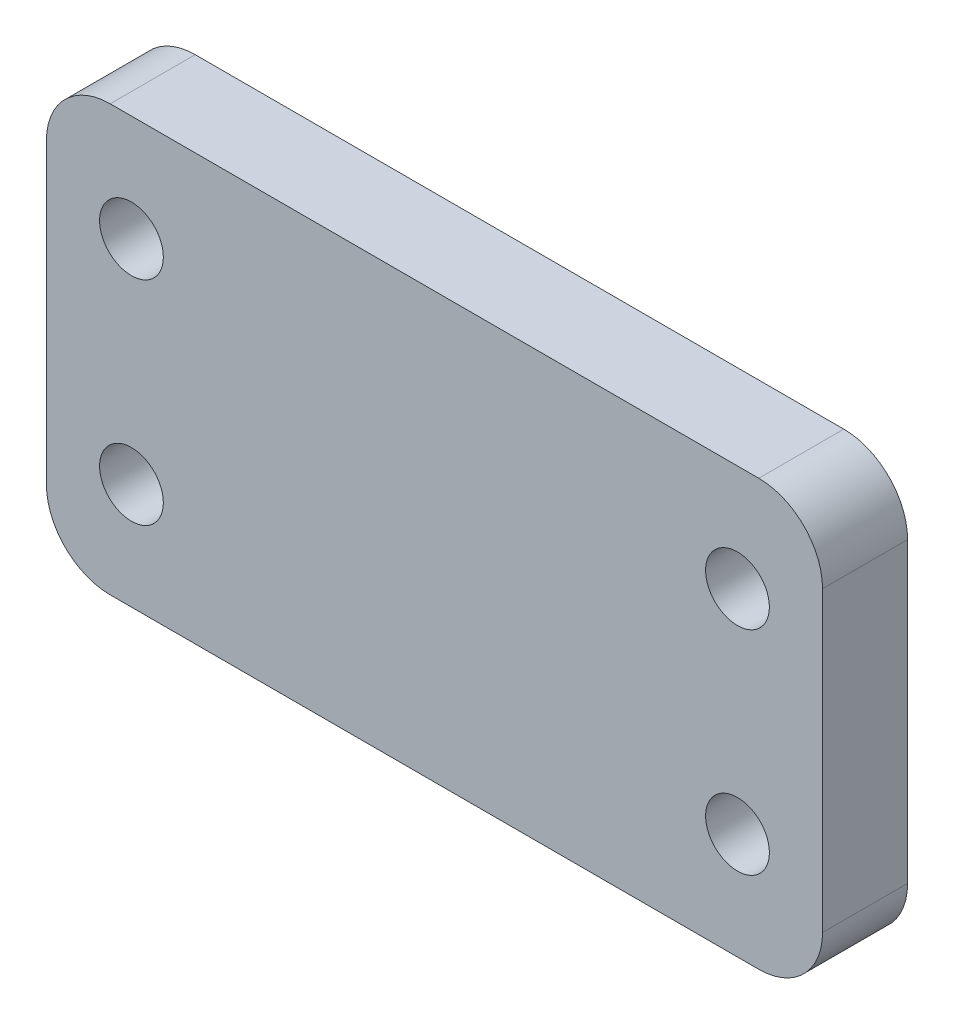
ISO-10303-21;
HEADER;
FILE_DESCRIPTION(('STEP AP214'),'2;1');
FILE_NAME('part.step','',(''),(''),'','','');
FILE_SCHEMA(('AUTOMOTIVE_DESIGN { 1 0 10303 214 1 1 1 1 }'));
ENDSEC;
DATA;
#1=APPLICATION_CONTEXT('core data for automotive mechanical design processes');
#2=APPLICATION_PROTOCOL_DEFINITION('international standard','automotive_design',2000,#1);
#3=PRODUCT_CONTEXT('',#1,'mechanical');
#4=PRODUCT('Part','Part','',(#3));
#5=PRODUCT_RELATED_PRODUCT_CATEGORY('part','',(#4));
#6=PRODUCT_DEFINITION_FORMATION('','',#4);
#7=PRODUCT_DEFINITION_CONTEXT('part definition',#1,'design');
#8=PRODUCT_DEFINITION('design','',#6,#7);
#9=PRODUCT_DEFINITION_SHAPE('','',#8);
#10=(LENGTH_UNIT() NAMED_UNIT(*) SI_UNIT(.MILLI.,.METRE.));
#11=(NAMED_UNIT(*) PLANE_ANGLE_UNIT() SI_UNIT($,.RADIAN.));
#12=(NAMED_UNIT(*) SI_UNIT($,.STERADIAN.) SOLID_ANGLE_UNIT());
#13=UNCERTAINTY_MEASURE_WITH_UNIT(LENGTH_MEASURE(1.E-05),#10,'distance_accuracy_value','');
#14=(GEOMETRIC_REPRESENTATION_CONTEXT(3) GLOBAL_UNCERTAINTY_ASSIGNED_CONTEXT((#13)) GLOBAL_UNIT_ASSIGNED_CONTEXT((#10,
#11,#12)) REPRESENTATION_CONTEXT('',''));
#15=CARTESIAN_POINT('',(0.,0.,0.));
#16=DIRECTION('',(0.,0.,1.));
#17=DIRECTION('',(1.,0.,0.));
#18=AXIS2_PLACEMENT_3D('',#15,#16,#17);
#19=CARTESIAN_POINT('',(4.13382344890571,4.0491279255457,4.));
#20=DIRECTION('',(0.,0.,1.));
#21=DIRECTION('',(1.,0.,0.));
#22=AXIS2_PLACEMENT_3D('',#19,#20,#21);
#23=PLANE('',#22);
#24=CARTESIAN_POINT('',(5.13382344890571,16.0491279255457,4.));
#25=DIRECTION('',(0.,0.,1.));
#26=DIRECTION('',(1.,0.,0.));
#27=AXIS2_PLACEMENT_3D('',#24,#25,#26);
#28=CIRCLE('',#27,1.5);
#29=CARTESIAN_POINT('',(6.63382344890571,16.0491279255457,4.));
#30=VERTEX_POINT('',#29);
#31=EDGE_CURVE('E187',#30,#30,#28,.T.);
#32=ORIENTED_EDGE('',*,*,#31,.F.);
#33=EDGE_LOOP('',(#32));
#34=FACE_BOUND('',#33,.T.);
#35=CARTESIAN_POINT('',(33.6338234489057,16.0491279255457,4.));
#36=DIRECTION('',(0.,0.,1.));
#37=DIRECTION('',(1.,0.,0.));
#38=AXIS2_PLACEMENT_3D('',#35,#36,#37);
#39=CIRCLE('',#38,1.5);
#40=CARTESIAN_POINT('',(35.1338234489057,16.0491279255457,4.));
#41=VERTEX_POINT('',#40);
#42=EDGE_CURVE('E133',#41,#41,#39,.T.);
#43=ORIENTED_EDGE('',*,*,#42,.F.);
#44=EDGE_LOOP('',(#43));
#45=FACE_BOUND('',#44,.T.);
#46=CARTESIAN_POINT('',(4.13382344890571,4.0491279255457,4.));
#47=DIRECTION('',(0.,0.,1.));
#48=DIRECTION('',(1.,0.,0.));
#49=AXIS2_PLACEMENT_3D('',#46,#47,#48);
#50=CIRCLE('',#49,3.);
#51=CARTESIAN_POINT('',(1.1338234489057,4.0491279255457,4.));
#52=VERTEX_POINT('',#51);
#53=CARTESIAN_POINT('',(4.13382344890571,1.0491279255457,4.));
#54=VERTEX_POINT('',#53);
#55=EDGE_CURVE('E144',#52,#54,#50,.T.);
#56=ORIENTED_EDGE('',*,*,#55,.T.);
#57=DIRECTION('',(1.,0.,0.));
#58=VECTOR('',#57,1.);
#59=CARTESIAN_POINT('',(4.13382344890571,1.0491279255457,4.));
#60=LINE('',#59,#58);
#61=CARTESIAN_POINT('',(34.6338234489056,1.0491279255457,4.));
#62=VERTEX_POINT('',#61);
#63=EDGE_CURVE('E92',#54,#62,#60,.T.);
#64=ORIENTED_EDGE('',*,*,#63,.T.);
#65=CARTESIAN_POINT('',(34.6338234489056,4.04912792554575,4.));
#66=DIRECTION('',(0.,0.,1.));
#67=DIRECTION('',(1.,0.,0.));
#68=AXIS2_PLACEMENT_3D('',#65,#66,#67);
#69=CIRCLE('',#68,3.00000000000005);
#70=CARTESIAN_POINT('',(37.6338234489057,4.04912792554575,4.));
#71=VERTEX_POINT('',#70);
#72=EDGE_CURVE('E159',#62,#71,#69,.T.);
#73=ORIENTED_EDGE('',*,*,#72,.T.);
#74=DIRECTION('',(0.,1.,0.));
#75=VECTOR('',#74,1.);
#76=CARTESIAN_POINT('',(37.6338234489057,18.0491278639543,4.));
#77=LINE('',#76,#75);
#78=CARTESIAN_POINT('',(37.6338234489057,18.0491278639543,4.));
#79=VERTEX_POINT('',#78);
#80=EDGE_CURVE('E172',#71,#79,#77,.T.);
#81=ORIENTED_EDGE('',*,*,#80,.T.);
#82=CARTESIAN_POINT('',(34.6338234489057,18.0491278639543,4.));
#83=DIRECTION('',(0.,0.,1.));
#84=DIRECTION('',(1.,0.,0.));
#85=AXIS2_PLACEMENT_3D('',#82,#83,#84);
#86=CIRCLE('',#85,3.);
#87=CARTESIAN_POINT('',(34.6338234489057,21.0491278639543,4.));
#88=VERTEX_POINT('',#87);
#89=EDGE_CURVE('E111',#79,#88,#86,.T.);
#90=ORIENTED_EDGE('',*,*,#89,.T.);
#91=DIRECTION('',(-1.,0.,0.));
#92=VECTOR('',#91,1.);
#93=CARTESIAN_POINT('',(4.13382344890571,21.0491278639543,4.));
#94=LINE('',#93,#92);
#95=CARTESIAN_POINT('',(4.13382344890571,21.0491278639543,4.));
#96=VERTEX_POINT('',#95);
#97=EDGE_CURVE('E105',#88,#96,#94,.T.);
#98=ORIENTED_EDGE('',*,*,#97,.T.);
#99=CARTESIAN_POINT('',(4.13382344890571,18.0491278639543,4.));
#100=DIRECTION('',(0.,0.,1.));
#101=DIRECTION('',(1.,0.,0.));
#102=AXIS2_PLACEMENT_3D('',#99,#100,#101);
#103=CIRCLE('',#102,3.);
#104=CARTESIAN_POINT('',(1.13382344890571,18.0491278639543,4.));
#105=VERTEX_POINT('',#104);
#106=EDGE_CURVE('E109',#96,#105,#103,.T.);
#107=ORIENTED_EDGE('',*,*,#106,.T.);
#108=DIRECTION('',(0.,-1.,0.));
#109=VECTOR('',#108,1.);
#110=CARTESIAN_POINT('',(1.1338234489057,18.0491278639543,4.));
#111=LINE('',#110,#109);
#112=EDGE_CURVE('E49',#105,#52,#111,.T.);
#113=ORIENTED_EDGE('',*,*,#112,.T.);
#114=EDGE_LOOP('',(#56,#64,#73,#81,#90,#98,#107,#113));
#115=FACE_BOUND('',#114,.T.);
#116=CARTESIAN_POINT('',(33.6338234489057,6.0491279255457,4.));
#117=DIRECTION('',(0.,0.,1.));
#118=DIRECTION('',(1.,0.,0.));
#119=AXIS2_PLACEMENT_3D('',#116,#117,#118);
#120=CIRCLE('',#119,1.5);
#121=CARTESIAN_POINT('',(35.1338234489057,6.0491279255457,4.));
#122=VERTEX_POINT('',#121);
#123=EDGE_CURVE('E181',#122,#122,#120,.T.);
#124=ORIENTED_EDGE('',*,*,#123,.F.);
#125=EDGE_LOOP('',(#124));
#126=FACE_BOUND('',#125,.T.);
#127=CARTESIAN_POINT('',(5.13382344890571,6.0491279255457,4.));
#128=DIRECTION('',(0.,0.,1.));
#129=DIRECTION('',(1.,0.,0.));
#130=AXIS2_PLACEMENT_3D('',#127,#128,#129);
#131=CIRCLE('',#130,1.5);
#132=CARTESIAN_POINT('',(6.63382344890571,6.0491279255457,4.));
#133=VERTEX_POINT('',#132);
#134=EDGE_CURVE('E193',#133,#133,#131,.T.);
#135=ORIENTED_EDGE('',*,*,#134,.F.);
#136=EDGE_LOOP('',(#135));
#137=FACE_BOUND('',#136,.T.);
#138=ADVANCED_FACE('F32',(#34,#45,#115,#126,#137),#23,.T.);
#139=CARTESIAN_POINT('',(4.13382344890571,4.0491279255457,0.));
#140=DIRECTION('',(0.,0.,1.));
#141=DIRECTION('',(1.,0.,0.));
#142=AXIS2_PLACEMENT_3D('',#139,#140,#141);
#143=PLANE('',#142);
#144=CARTESIAN_POINT('',(5.13382344890571,16.0491279255457,0.));
#145=DIRECTION('',(0.,0.,1.));
#146=DIRECTION('',(1.,0.,0.));
#147=AXIS2_PLACEMENT_3D('',#144,#145,#146);
#148=CIRCLE('',#147,1.5);
#149=CARTESIAN_POINT('',(6.63382344890571,16.0491279255457,0.));
#150=VERTEX_POINT('',#149);
#151=EDGE_CURVE('E190',#150,#150,#148,.T.);
#152=ORIENTED_EDGE('',*,*,#151,.T.);
#153=EDGE_LOOP('',(#152));
#154=FACE_BOUND('',#153,.T.);
#155=CARTESIAN_POINT('',(33.6338234489057,16.0491279255457,0.));
#156=DIRECTION('',(0.,0.,1.));
#157=DIRECTION('',(1.,0.,0.));
#158=AXIS2_PLACEMENT_3D('',#155,#156,#157);
#159=CIRCLE('',#158,1.5);
#160=CARTESIAN_POINT('',(35.1338234489057,16.0491279255457,0.));
#161=VERTEX_POINT('',#160);
#162=EDGE_CURVE('E178',#161,#161,#159,.T.);
#163=ORIENTED_EDGE('',*,*,#162,.T.);
#164=EDGE_LOOP('',(#163));
#165=FACE_BOUND('',#164,.T.);
#166=CARTESIAN_POINT('',(4.13382344890571,4.0491279255457,0.));
#167=DIRECTION('',(0.,0.,1.));
#168=DIRECTION('',(1.,0.,0.));
#169=AXIS2_PLACEMENT_3D('',#166,#167,#168);
#170=CIRCLE('',#169,3.);
#171=CARTESIAN_POINT('',(1.1338234489057,4.0491279255457,0.));
#172=VERTEX_POINT('',#171);
#173=CARTESIAN_POINT('',(4.13382344890571,1.0491279255457,0.));
#174=VERTEX_POINT('',#173);
#175=EDGE_CURVE('E129',#172,#174,#170,.T.);
#176=ORIENTED_EDGE('',*,*,#175,.F.);
#177=DIRECTION('',(0.,-1.,0.));
#178=VECTOR('',#177,1.);
#179=CARTESIAN_POINT('',(1.1338234489057,18.0491278639543,0.));
#180=LINE('',#179,#178);
#181=CARTESIAN_POINT('',(1.13382344890571,18.0491278639543,0.));
#182=VERTEX_POINT('',#181);
#183=EDGE_CURVE('E84',#182,#172,#180,.T.);
#184=ORIENTED_EDGE('',*,*,#183,.F.);
#185=CARTESIAN_POINT('',(4.13382344890571,18.0491278639543,0.));
#186=DIRECTION('',(0.,0.,1.));
#187=DIRECTION('',(1.,0.,0.));
#188=AXIS2_PLACEMENT_3D('',#185,#186,#187);
#189=CIRCLE('',#188,3.);
#190=CARTESIAN_POINT('',(4.13382344890571,21.0491278639543,0.));
#191=VERTEX_POINT('',#190);
#192=EDGE_CURVE('E78',#191,#182,#189,.T.);
#193=ORIENTED_EDGE('',*,*,#192,.F.);
#194=DIRECTION('',(-1.,0.,0.));
#195=VECTOR('',#194,1.);
#196=CARTESIAN_POINT('',(4.13382344890571,21.0491278639543,0.));
#197=LINE('',#196,#195);
#198=CARTESIAN_POINT('',(34.6338234489057,21.0491278639543,0.));
#199=VERTEX_POINT('',#198);
#200=EDGE_CURVE('E119',#199,#191,#197,.T.);
#201=ORIENTED_EDGE('',*,*,#200,.F.);
#202=CARTESIAN_POINT('',(34.6338234489057,18.0491278639543,0.));
#203=DIRECTION('',(0.,0.,1.));
#204=DIRECTION('',(1.,0.,0.));
#205=AXIS2_PLACEMENT_3D('',#202,#203,#204);
#206=CIRCLE('',#205,3.);
#207=CARTESIAN_POINT('',(37.6338234489057,18.0491278639543,0.));
#208=VERTEX_POINT('',#207);
#209=EDGE_CURVE('E139',#208,#199,#206,.T.);
#210=ORIENTED_EDGE('',*,*,#209,.F.);
#211=DIRECTION('',(0.,1.,0.));
#212=VECTOR('',#211,1.);
#213=CARTESIAN_POINT('',(37.6338234489057,18.0491278639543,0.));
#214=LINE('',#213,#212);
#215=CARTESIAN_POINT('',(37.6338234489057,4.04912792554575,0.));
#216=VERTEX_POINT('',#215);
#217=EDGE_CURVE('E137',#216,#208,#214,.T.);
#218=ORIENTED_EDGE('',*,*,#217,.F.);
#219=CARTESIAN_POINT('',(34.6338234489056,4.04912792554575,0.));
#220=DIRECTION('',(0.,0.,1.));
#221=DIRECTION('',(1.,0.,0.));
#222=AXIS2_PLACEMENT_3D('',#219,#220,#221);
#223=CIRCLE('',#222,3.00000000000005);
#224=CARTESIAN_POINT('',(34.6338234489056,1.0491279255457,0.));
#225=VERTEX_POINT('',#224);
#226=EDGE_CURVE('E135',#225,#216,#223,.T.);
#227=ORIENTED_EDGE('',*,*,#226,.F.);
#228=DIRECTION('',(1.,0.,0.));
#229=VECTOR('',#228,1.);
#230=CARTESIAN_POINT('',(4.13382344890571,1.0491279255457,0.));
#231=LINE('',#230,#229);
#232=EDGE_CURVE('E132',#174,#225,#231,.T.);
#233=ORIENTED_EDGE('',*,*,#232,.F.);
#234=EDGE_LOOP('',(#176,#184,#193,#201,#210,#218,#227,#233));
#235=FACE_BOUND('',#234,.T.);
#236=CARTESIAN_POINT('',(33.6338234489057,6.0491279255457,0.));
#237=DIRECTION('',(0.,0.,1.));
#238=DIRECTION('',(1.,0.,0.));
#239=AXIS2_PLACEMENT_3D('',#236,#237,#238);
#240=CIRCLE('',#239,1.5);
#241=CARTESIAN_POINT('',(35.1338234489057,6.0491279255457,0.));
#242=VERTEX_POINT('',#241);
#243=EDGE_CURVE('E184',#242,#242,#240,.T.);
#244=ORIENTED_EDGE('',*,*,#243,.T.);
#245=EDGE_LOOP('',(#244));
#246=FACE_BOUND('',#245,.T.);
#247=CARTESIAN_POINT('',(5.13382344890571,6.0491279255457,0.));
#248=DIRECTION('',(0.,0.,1.));
#249=DIRECTION('',(1.,0.,0.));
#250=AXIS2_PLACEMENT_3D('',#247,#248,#249);
#251=CIRCLE('',#250,1.5);
#252=CARTESIAN_POINT('',(6.63382344890571,6.0491279255457,0.));
#253=VERTEX_POINT('',#252);
#254=EDGE_CURVE('E196',#253,#253,#251,.T.);
#255=ORIENTED_EDGE('',*,*,#254,.T.);
#256=EDGE_LOOP('',(#255));
#257=FACE_BOUND('',#256,.T.);
#258=ADVANCED_FACE('F163',(#154,#165,#235,#246,#257),#143,.F.);
#259=CARTESIAN_POINT('',(4.13382344890571,4.0491279255457,4.));
#260=DIRECTION('',(0.,0.,-1.));
#261=DIRECTION('',(-1.,0.,0.));
#262=AXIS2_PLACEMENT_3D('',#259,#260,#261);
#263=CYLINDRICAL_SURFACE('',#262,3.);
#264=ORIENTED_EDGE('',*,*,#175,.T.);
#265=DIRECTION('',(0.,0.,-1.));
#266=VECTOR('',#265,1.);
#267=CARTESIAN_POINT('',(4.13382344890571,1.0491279255457,4.));
#268=LINE('',#267,#266);
#269=EDGE_CURVE('E11',#54,#174,#268,.T.);
#270=ORIENTED_EDGE('',*,*,#269,.F.);
#271=ORIENTED_EDGE('',*,*,#55,.F.);
#272=DIRECTION('',(0.,0.,-1.));
#273=VECTOR('',#272,1.);
#274=CARTESIAN_POINT('',(1.1338234489057,4.0491279255457,4.));
#275=LINE('',#274,#273);
#276=EDGE_CURVE('E125',#52,#172,#275,.T.);
#277=ORIENTED_EDGE('',*,*,#276,.T.);
#278=EDGE_LOOP('',(#264,#270,#271,#277));
#279=FACE_BOUND('',#278,.T.);
#280=ADVANCED_FACE('F34',(#279),#263,.T.);
#281=CARTESIAN_POINT('',(4.13382344890571,1.0491279255457,4.));
#282=DIRECTION('',(0.,1.,0.));
#283=DIRECTION('',(0.,0.,1.));
#284=AXIS2_PLACEMENT_3D('',#281,#282,#283);
#285=PLANE('',#284);
#286=ORIENTED_EDGE('',*,*,#232,.T.);
#287=DIRECTION('',(0.,0.,-1.));
#288=VECTOR('',#287,1.);
#289=CARTESIAN_POINT('',(34.6338234489056,1.0491279255457,4.));
#290=LINE('',#289,#288);
#291=EDGE_CURVE('E41',#62,#225,#290,.T.);
#292=ORIENTED_EDGE('',*,*,#291,.F.);
#293=ORIENTED_EDGE('',*,*,#63,.F.);
#294=ORIENTED_EDGE('',*,*,#269,.T.);
#295=EDGE_LOOP('',(#286,#292,#293,#294));
#296=FACE_BOUND('',#295,.T.);
#297=ADVANCED_FACE('F231',(#296),#285,.F.);
#298=CARTESIAN_POINT('',(34.6338234489056,4.04912792554575,4.));
#299=DIRECTION('',(0.,0.,-1.));
#300=DIRECTION('',(-1.,0.,0.));
#301=AXIS2_PLACEMENT_3D('',#298,#299,#300);
#302=CYLINDRICAL_SURFACE('',#301,3.00000000000005);
#303=ORIENTED_EDGE('',*,*,#226,.T.);
#304=DIRECTION('',(0.,0.,-1.));
#305=VECTOR('',#304,1.);
#306=CARTESIAN_POINT('',(37.6338234489057,4.04912792554575,4.));
#307=LINE('',#306,#305);
#308=EDGE_CURVE('E151',#71,#216,#307,.T.);
#309=ORIENTED_EDGE('',*,*,#308,.F.);
#310=ORIENTED_EDGE('',*,*,#72,.F.);
#311=ORIENTED_EDGE('',*,*,#291,.T.);
#312=EDGE_LOOP('',(#303,#309,#310,#311));
#313=FACE_BOUND('',#312,.T.);
#314=ADVANCED_FACE('F157',(#313),#302,.T.);
#315=CARTESIAN_POINT('',(37.6338234489057,18.0491278639543,4.));
#316=DIRECTION('',(-1.,0.,0.));
#317=DIRECTION('',(0.,0.,1.));
#318=AXIS2_PLACEMENT_3D('',#315,#316,#317);
#319=PLANE('',#318);
#320=ORIENTED_EDGE('',*,*,#217,.T.);
#321=DIRECTION('',(0.,0.,-1.));
#322=VECTOR('',#321,1.);
#323=CARTESIAN_POINT('',(37.6338234489057,18.0491278639543,4.));
#324=LINE('',#323,#322);
#325=EDGE_CURVE('E148',#79,#208,#324,.T.);
#326=ORIENTED_EDGE('',*,*,#325,.F.);
#327=ORIENTED_EDGE('',*,*,#80,.F.);
#328=ORIENTED_EDGE('',*,*,#308,.T.);
#329=EDGE_LOOP('',(#320,#326,#327,#328));
#330=FACE_BOUND('',#329,.T.);
#331=ADVANCED_FACE('F168',(#330),#319,.F.);
#332=CARTESIAN_POINT('',(34.6338234489057,18.0491278639543,4.));
#333=DIRECTION('',(0.,0.,-1.));
#334=DIRECTION('',(-1.,0.,0.));
#335=AXIS2_PLACEMENT_3D('',#332,#333,#334);
#336=CYLINDRICAL_SURFACE('',#335,3.);
#337=ORIENTED_EDGE('',*,*,#209,.T.);
#338=DIRECTION('',(0.,0.,-1.));
#339=VECTOR('',#338,1.);
#340=CARTESIAN_POINT('',(34.6338234489057,21.0491278639543,4.));
#341=LINE('',#340,#339);
#342=EDGE_CURVE('E120',#88,#199,#341,.T.);
#343=ORIENTED_EDGE('',*,*,#342,.F.);
#344=ORIENTED_EDGE('',*,*,#89,.F.);
#345=ORIENTED_EDGE('',*,*,#325,.T.);
#346=EDGE_LOOP('',(#337,#343,#344,#345));
#347=FACE_BOUND('',#346,.T.);
#348=ADVANCED_FACE('F171',(#347),#336,.T.);
#349=CARTESIAN_POINT('',(4.13382344890571,21.0491278639543,4.));
#350=DIRECTION('',(0.,-1.,0.));
#351=DIRECTION('',(0.,0.,-1.));
#352=AXIS2_PLACEMENT_3D('',#349,#350,#351);
#353=PLANE('',#352);
#354=ORIENTED_EDGE('',*,*,#200,.T.);
#355=DIRECTION('',(0.,0.,-1.));
#356=VECTOR('',#355,1.);
#357=CARTESIAN_POINT('',(4.13382344890571,21.0491278639543,4.));
#358=LINE('',#357,#356);
#359=EDGE_CURVE('E116',#96,#191,#358,.T.);
#360=ORIENTED_EDGE('',*,*,#359,.F.);
#361=ORIENTED_EDGE('',*,*,#97,.F.);
#362=ORIENTED_EDGE('',*,*,#342,.T.);
#363=EDGE_LOOP('',(#354,#360,#361,#362));
#364=FACE_BOUND('',#363,.T.);
#365=ADVANCED_FACE('F117',(#364),#353,.F.);
#366=CARTESIAN_POINT('',(4.13382344890571,18.0491278639543,4.));
#367=DIRECTION('',(0.,0.,-1.));
#368=DIRECTION('',(-1.,0.,0.));
#369=AXIS2_PLACEMENT_3D('',#366,#367,#368);
#370=CYLINDRICAL_SURFACE('',#369,3.);
#371=ORIENTED_EDGE('',*,*,#192,.T.);
#372=DIRECTION('',(0.,0.,-1.));
#373=VECTOR('',#372,1.);
#374=CARTESIAN_POINT('',(1.13382344890571,18.0491278639543,4.));
#375=LINE('',#374,#373);
#376=EDGE_CURVE('E121',#105,#182,#375,.T.);
#377=ORIENTED_EDGE('',*,*,#376,.F.);
#378=ORIENTED_EDGE('',*,*,#106,.F.);
#379=ORIENTED_EDGE('',*,*,#359,.T.);
#380=EDGE_LOOP('',(#371,#377,#378,#379));
#381=FACE_BOUND('',#380,.T.);
#382=ADVANCED_FACE('F123',(#381),#370,.T.);
#383=CARTESIAN_POINT('',(1.1338234489057,18.0491278639543,4.));
#384=DIRECTION('',(1.,0.,0.));
#385=DIRECTION('',(0.,0.,-1.));
#386=AXIS2_PLACEMENT_3D('',#383,#384,#385);
#387=PLANE('',#386);
#388=ORIENTED_EDGE('',*,*,#183,.T.);
#389=ORIENTED_EDGE('',*,*,#276,.F.);
#390=ORIENTED_EDGE('',*,*,#112,.F.);
#391=ORIENTED_EDGE('',*,*,#376,.T.);
#392=EDGE_LOOP('',(#388,#389,#390,#391));
#393=FACE_BOUND('',#392,.T.);
#394=ADVANCED_FACE('F219',(#393),#387,.F.);
#395=CARTESIAN_POINT('',(33.6338234489057,16.0491279255457,4.));
#396=DIRECTION('',(0.,0.,-1.));
#397=DIRECTION('',(-1.,0.,0.));
#398=AXIS2_PLACEMENT_3D('',#395,#396,#397);
#399=CYLINDRICAL_SURFACE('',#398,1.5);
#400=ORIENTED_EDGE('',*,*,#42,.T.);
#401=EDGE_LOOP('',(#400));
#402=FACE_BOUND('',#401,.T.);
#403=ORIENTED_EDGE('',*,*,#162,.F.);
#404=EDGE_LOOP('',(#403));
#405=FACE_BOUND('',#404,.T.);
#406=ADVANCED_FACE('F216',(#402,#405),#399,.F.);
#407=CARTESIAN_POINT('',(33.6338234489057,6.0491279255457,4.));
#408=DIRECTION('',(0.,0.,-1.));
#409=DIRECTION('',(-1.,0.,0.));
#410=AXIS2_PLACEMENT_3D('',#407,#408,#409);
#411=CYLINDRICAL_SURFACE('',#410,1.5);
#412=ORIENTED_EDGE('',*,*,#123,.T.);
#413=EDGE_LOOP('',(#412));
#414=FACE_BOUND('',#413,.T.);
#415=ORIENTED_EDGE('',*,*,#243,.F.);
#416=EDGE_LOOP('',(#415));
#417=FACE_BOUND('',#416,.T.);
#418=ADVANCED_FACE('F295',(#414,#417),#411,.F.);
#419=CARTESIAN_POINT('',(5.13382344890571,16.0491279255457,4.));
#420=DIRECTION('',(0.,0.,-1.));
#421=DIRECTION('',(-1.,0.,0.));
#422=AXIS2_PLACEMENT_3D('',#419,#420,#421);
#423=CYLINDRICAL_SURFACE('',#422,1.5);
#424=ORIENTED_EDGE('',*,*,#31,.T.);
#425=EDGE_LOOP('',(#424));
#426=FACE_BOUND('',#425,.T.);
#427=ORIENTED_EDGE('',*,*,#151,.F.);
#428=EDGE_LOOP('',(#427));
#429=FACE_BOUND('',#428,.T.);
#430=ADVANCED_FACE('F303',(#426,#429),#423,.F.);
#431=CARTESIAN_POINT('',(5.13382344890571,6.0491279255457,4.));
#432=DIRECTION('',(0.,0.,-1.));
#433=DIRECTION('',(-1.,0.,0.));
#434=AXIS2_PLACEMENT_3D('',#431,#432,#433);
#435=CYLINDRICAL_SURFACE('',#434,1.5);
#436=ORIENTED_EDGE('',*,*,#134,.T.);
#437=EDGE_LOOP('',(#436));
#438=FACE_BOUND('',#437,.T.);
#439=ORIENTED_EDGE('',*,*,#254,.F.);
#440=EDGE_LOOP('',(#439));
#441=FACE_BOUND('',#440,.T.);
#442=ADVANCED_FACE('F202',(#438,#441),#435,.F.);
#443=CLOSED_SHELL('',(#138,#258,#280,#297,#314,#331,#348,#365,#382,#394,#406,#418,#430,#442));
#444=MANIFOLD_SOLID_BREP('B2',#443);
#445=ADVANCED_BREP_SHAPE_REPRESENTATION('',(#18,#444),#14);
#446=SHAPE_DEFINITION_REPRESENTATION(#9,#445);
ENDSEC;
END-ISO-10303-21;
